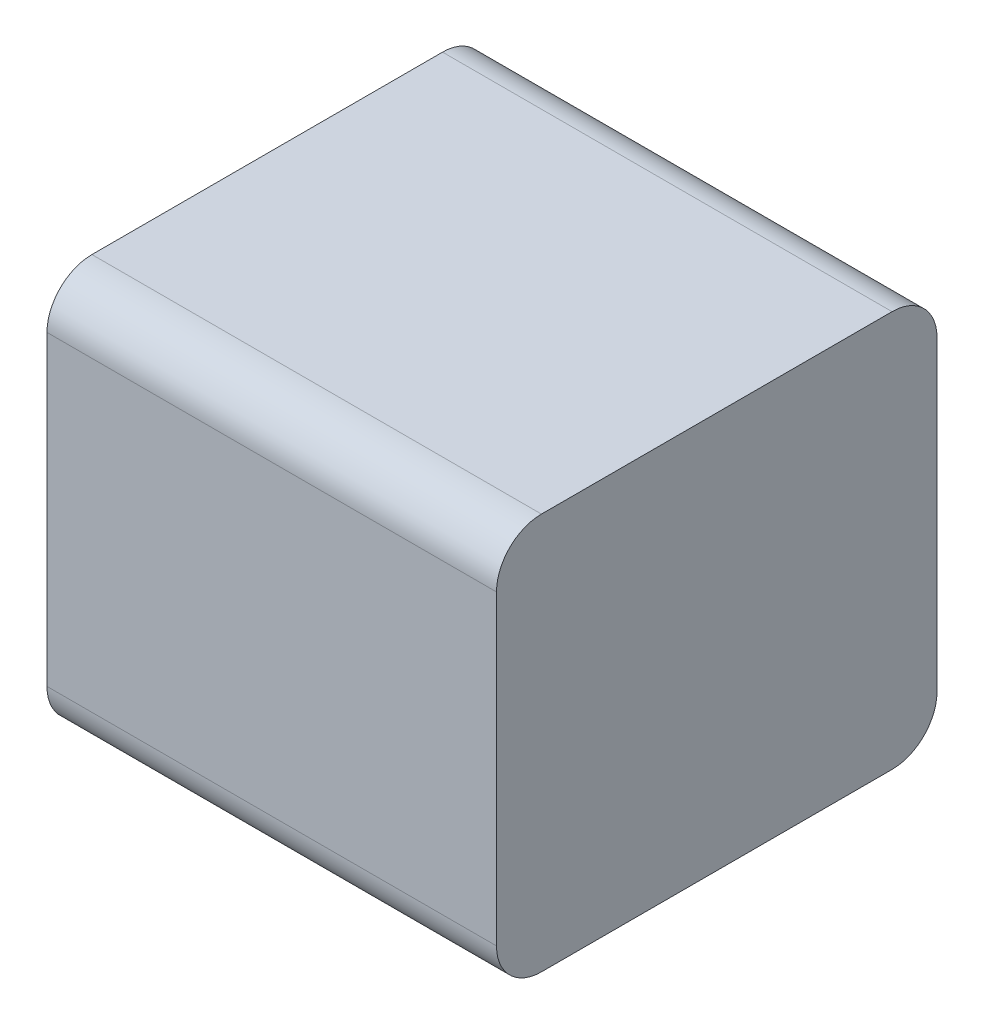
ISO-10303-21;
HEADER;
FILE_DESCRIPTION(('STEP AP214'),'2;1');
FILE_NAME('part.step','',(''),(''),'','','');
FILE_SCHEMA(('AUTOMOTIVE_DESIGN { 1 0 10303 214 1 1 1 1 }'));
ENDSEC;
DATA;
#1=APPLICATION_CONTEXT('core data for automotive mechanical design processes');
#2=APPLICATION_PROTOCOL_DEFINITION('international standard','automotive_design',2000,#1);
#3=PRODUCT_CONTEXT('',#1,'mechanical');
#4=PRODUCT('Part','Part','',(#3));
#5=PRODUCT_RELATED_PRODUCT_CATEGORY('part','',(#4));
#6=PRODUCT_DEFINITION_FORMATION('','',#4);
#7=PRODUCT_DEFINITION_CONTEXT('part definition',#1,'design');
#8=PRODUCT_DEFINITION('design','',#6,#7);
#9=PRODUCT_DEFINITION_SHAPE('','',#8);
#10=(LENGTH_UNIT() NAMED_UNIT(*) SI_UNIT(.MILLI.,.METRE.));
#11=(NAMED_UNIT(*) PLANE_ANGLE_UNIT() SI_UNIT($,.RADIAN.));
#12=(NAMED_UNIT(*) SI_UNIT($,.STERADIAN.) SOLID_ANGLE_UNIT());
#13=UNCERTAINTY_MEASURE_WITH_UNIT(LENGTH_MEASURE(1.E-05),#10,'distance_accuracy_value','');
#14=(GEOMETRIC_REPRESENTATION_CONTEXT(3) GLOBAL_UNCERTAINTY_ASSIGNED_CONTEXT((#13)) GLOBAL_UNIT_ASSIGNED_CONTEXT((#10,
#11,#12)) REPRESENTATION_CONTEXT('',''));
#15=CARTESIAN_POINT('',(0.,0.,0.));
#16=DIRECTION('',(0.,0.,1.));
#17=DIRECTION('',(1.,0.,0.));
#18=AXIS2_PLACEMENT_3D('',#15,#16,#17);
#19=CARTESIAN_POINT('',(-0.45,-0.3969,0.009));
#20=DIRECTION('',(1.,0.,0.));
#21=DIRECTION('',(0.,0.,1.));
#22=AXIS2_PLACEMENT_3D('',#19,#20,#21);
#23=PLANE('',#22);
#24=CARTESIAN_POINT('',(-0.45,-0.3069,0.801));
#25=DIRECTION('',(-1.,0.,0.));
#26=DIRECTION('',(0.,0.,1.));
#27=AXIS2_PLACEMENT_3D('',#24,#25,#26);
#28=CIRCLE('',#27,0.09);
#29=CARTESIAN_POINT('',(-0.45,-0.3969,0.801));
#30=VERTEX_POINT('',#29);
#31=CARTESIAN_POINT('',(-0.45,-0.3069,0.891));
#32=VERTEX_POINT('',#31);
#33=EDGE_CURVE('E11',#30,#32,#28,.T.);
#34=ORIENTED_EDGE('',*,*,#33,.T.);
#35=DIRECTION('',(0.,1.,0.));
#36=VECTOR('',#35,1.);
#37=CARTESIAN_POINT('',(-0.45,-0.3969,0.891));
#38=LINE('',#37,#36);
#39=CARTESIAN_POINT('',(-0.45,0.3069,0.891));
#40=VERTEX_POINT('',#39);
#41=EDGE_CURVE('E24',#32,#40,#38,.T.);
#42=ORIENTED_EDGE('',*,*,#41,.T.);
#43=CARTESIAN_POINT('',(-0.45,0.3069,0.801));
#44=DIRECTION('',(1.,0.,0.));
#45=DIRECTION('',(0.,0.,1.));
#46=AXIS2_PLACEMENT_3D('',#43,#44,#45);
#47=CIRCLE('',#46,0.09);
#48=CARTESIAN_POINT('',(-0.45,0.3969,0.801));
#49=VERTEX_POINT('',#48);
#50=EDGE_CURVE('E143',#49,#40,#47,.T.);
#51=ORIENTED_EDGE('',*,*,#50,.F.);
#52=DIRECTION('',(0.,0.,1.));
#53=VECTOR('',#52,1.);
#54=CARTESIAN_POINT('',(-0.45,0.3969,0.009));
#55=LINE('',#54,#53);
#56=CARTESIAN_POINT('',(-0.45,0.3969,0.099));
#57=VERTEX_POINT('',#56);
#58=EDGE_CURVE('E98',#57,#49,#55,.T.);
#59=ORIENTED_EDGE('',*,*,#58,.F.);
#60=CARTESIAN_POINT('',(-0.45,0.3069,0.099));
#61=DIRECTION('',(-1.,0.,0.));
#62=DIRECTION('',(0.,0.,1.));
#63=AXIS2_PLACEMENT_3D('',#60,#61,#62);
#64=CIRCLE('',#63,0.09);
#65=CARTESIAN_POINT('',(-0.45,0.3069,0.009));
#66=VERTEX_POINT('',#65);
#67=EDGE_CURVE('E139',#57,#66,#64,.T.);
#68=ORIENTED_EDGE('',*,*,#67,.T.);
#69=DIRECTION('',(0.,1.,0.));
#70=VECTOR('',#69,1.);
#71=CARTESIAN_POINT('',(-0.45,-0.3969,0.009));
#72=LINE('',#71,#70);
#73=CARTESIAN_POINT('',(-0.45,-0.3069,0.009));
#74=VERTEX_POINT('',#73);
#75=EDGE_CURVE('E137',#74,#66,#72,.T.);
#76=ORIENTED_EDGE('',*,*,#75,.F.);
#77=CARTESIAN_POINT('',(-0.45,-0.3069,0.099));
#78=DIRECTION('',(1.,0.,0.));
#79=DIRECTION('',(0.,0.,1.));
#80=AXIS2_PLACEMENT_3D('',#77,#78,#79);
#81=CIRCLE('',#80,0.09);
#82=CARTESIAN_POINT('',(-0.45,-0.3969,0.099));
#83=VERTEX_POINT('',#82);
#84=EDGE_CURVE('E135',#83,#74,#81,.T.);
#85=ORIENTED_EDGE('',*,*,#84,.F.);
#86=DIRECTION('',(0.,0.,1.));
#87=VECTOR('',#86,1.);
#88=CARTESIAN_POINT('',(-0.45,-0.3969,0.009));
#89=LINE('',#88,#87);
#90=EDGE_CURVE('E36',#83,#30,#89,.T.);
#91=ORIENTED_EDGE('',*,*,#90,.T.);
#92=EDGE_LOOP('',(#34,#42,#51,#59,#68,#76,#85,#91));
#93=FACE_BOUND('',#92,.T.);
#94=ADVANCED_FACE('F17',(#93),#23,.F.);
#95=CARTESIAN_POINT('',(-0.45,-0.3969,0.009));
#96=DIRECTION('',(0.,1.,0.));
#97=DIRECTION('',(0.,0.,1.));
#98=AXIS2_PLACEMENT_3D('',#95,#96,#97);
#99=PLANE('',#98);
#100=DIRECTION('',(1.,0.,0.));
#101=VECTOR('',#100,1.);
#102=CARTESIAN_POINT('',(-0.45,-0.3969,0.801));
#103=LINE('',#102,#101);
#104=CARTESIAN_POINT('',(0.45,-0.3969,0.801));
#105=VERTEX_POINT('',#104);
#106=EDGE_CURVE('E131',#30,#105,#103,.T.);
#107=ORIENTED_EDGE('',*,*,#106,.F.);
#108=ORIENTED_EDGE('',*,*,#90,.F.);
#109=DIRECTION('',(1.,0.,0.));
#110=VECTOR('',#109,1.);
#111=CARTESIAN_POINT('',(-0.45,-0.3969,0.099));
#112=LINE('',#111,#110);
#113=CARTESIAN_POINT('',(0.45,-0.3969,0.099));
#114=VERTEX_POINT('',#113);
#115=EDGE_CURVE('E128',#83,#114,#112,.T.);
#116=ORIENTED_EDGE('',*,*,#115,.T.);
#117=DIRECTION('',(0.,0.,1.));
#118=VECTOR('',#117,1.);
#119=CARTESIAN_POINT('',(0.45,-0.3969,0.009));
#120=LINE('',#119,#118);
#121=EDGE_CURVE('E126',#114,#105,#120,.T.);
#122=ORIENTED_EDGE('',*,*,#121,.T.);
#123=EDGE_LOOP('',(#107,#108,#116,#122));
#124=FACE_BOUND('',#123,.T.);
#125=ADVANCED_FACE('F151',(#124),#99,.F.);
#126=CARTESIAN_POINT('',(-0.45,-0.3069,0.099));
#127=DIRECTION('',(1.,0.,0.));
#128=DIRECTION('',(0.,-1.,0.));
#129=AXIS2_PLACEMENT_3D('',#126,#127,#128);
#130=CYLINDRICAL_SURFACE('',#129,0.09);
#131=ORIENTED_EDGE('',*,*,#84,.T.);
#132=DIRECTION('',(1.,0.,0.));
#133=VECTOR('',#132,1.);
#134=CARTESIAN_POINT('',(-0.45,-0.3069,0.009));
#135=LINE('',#134,#133);
#136=CARTESIAN_POINT('',(0.45,-0.3069,0.009));
#137=VERTEX_POINT('',#136);
#138=EDGE_CURVE('E124',#74,#137,#135,.T.);
#139=ORIENTED_EDGE('',*,*,#138,.T.);
#140=CARTESIAN_POINT('',(0.45,-0.3069,0.099));
#141=DIRECTION('',(1.,0.,0.));
#142=DIRECTION('',(0.,0.,1.));
#143=AXIS2_PLACEMENT_3D('',#140,#141,#142);
#144=CIRCLE('',#143,0.09);
#145=EDGE_CURVE('E121',#114,#137,#144,.T.);
#146=ORIENTED_EDGE('',*,*,#145,.F.);
#147=ORIENTED_EDGE('',*,*,#115,.F.);
#148=EDGE_LOOP('',(#131,#139,#146,#147));
#149=FACE_BOUND('',#148,.T.);
#150=ADVANCED_FACE('F155',(#149),#130,.T.);
#151=CARTESIAN_POINT('',(-0.45,-0.3069,0.801));
#152=DIRECTION('',(1.,0.,0.));
#153=DIRECTION('',(0.,-1.,0.));
#154=AXIS2_PLACEMENT_3D('',#151,#152,#153);
#155=CYLINDRICAL_SURFACE('',#154,0.09);
#156=ORIENTED_EDGE('',*,*,#106,.T.);
#157=CARTESIAN_POINT('',(0.45,-0.3069,0.801));
#158=DIRECTION('',(-1.,0.,0.));
#159=DIRECTION('',(0.,0.,1.));
#160=AXIS2_PLACEMENT_3D('',#157,#158,#159);
#161=CIRCLE('',#160,0.09);
#162=CARTESIAN_POINT('',(0.45,-0.3069,0.891));
#163=VERTEX_POINT('',#162);
#164=EDGE_CURVE('E119',#105,#163,#161,.T.);
#165=ORIENTED_EDGE('',*,*,#164,.T.);
#166=DIRECTION('',(1.,0.,0.));
#167=VECTOR('',#166,1.);
#168=CARTESIAN_POINT('',(-0.45,-0.3069,0.891));
#169=LINE('',#168,#167);
#170=EDGE_CURVE('E117',#32,#163,#169,.T.);
#171=ORIENTED_EDGE('',*,*,#170,.F.);
#172=ORIENTED_EDGE('',*,*,#33,.F.);
#173=EDGE_LOOP('',(#156,#165,#171,#172));
#174=FACE_BOUND('',#173,.T.);
#175=ADVANCED_FACE('F148',(#174),#155,.T.);
#176=CARTESIAN_POINT('',(-0.45,-0.3969,0.009));
#177=DIRECTION('',(0.,0.,1.));
#178=DIRECTION('',(1.,0.,0.));
#179=AXIS2_PLACEMENT_3D('',#176,#177,#178);
#180=PLANE('',#179);
#181=DIRECTION('',(1.,0.,0.));
#182=VECTOR('',#181,1.);
#183=CARTESIAN_POINT('',(-0.45,0.3069,0.009));
#184=LINE('',#183,#182);
#185=CARTESIAN_POINT('',(0.45,0.3069,0.009));
#186=VERTEX_POINT('',#185);
#187=EDGE_CURVE('E114',#66,#186,#184,.T.);
#188=ORIENTED_EDGE('',*,*,#187,.T.);
#189=DIRECTION('',(0.,1.,0.));
#190=VECTOR('',#189,1.);
#191=CARTESIAN_POINT('',(0.45,-0.3969,0.009));
#192=LINE('',#191,#190);
#193=EDGE_CURVE('E112',#137,#186,#192,.T.);
#194=ORIENTED_EDGE('',*,*,#193,.F.);
#195=ORIENTED_EDGE('',*,*,#138,.F.);
#196=ORIENTED_EDGE('',*,*,#75,.T.);
#197=EDGE_LOOP('',(#188,#194,#195,#196));
#198=FACE_BOUND('',#197,.T.);
#199=ADVANCED_FACE('F159',(#198),#180,.F.);
#200=CARTESIAN_POINT('',(-0.45,-0.3969,0.891));
#201=DIRECTION('',(0.,0.,1.));
#202=DIRECTION('',(1.,0.,0.));
#203=AXIS2_PLACEMENT_3D('',#200,#201,#202);
#204=PLANE('',#203);
#205=ORIENTED_EDGE('',*,*,#41,.F.);
#206=ORIENTED_EDGE('',*,*,#170,.T.);
#207=DIRECTION('',(0.,1.,0.));
#208=VECTOR('',#207,1.);
#209=CARTESIAN_POINT('',(0.45,-0.3969,0.891));
#210=LINE('',#209,#208);
#211=CARTESIAN_POINT('',(0.45,0.3069,0.891));
#212=VERTEX_POINT('',#211);
#213=EDGE_CURVE('E110',#163,#212,#210,.T.);
#214=ORIENTED_EDGE('',*,*,#213,.T.);
#215=DIRECTION('',(1.,0.,0.));
#216=VECTOR('',#215,1.);
#217=CARTESIAN_POINT('',(-0.45,0.3069,0.891));
#218=LINE('',#217,#216);
#219=EDGE_CURVE('E86',#40,#212,#218,.T.);
#220=ORIENTED_EDGE('',*,*,#219,.F.);
#221=EDGE_LOOP('',(#205,#206,#214,#220));
#222=FACE_BOUND('',#221,.T.);
#223=ADVANCED_FACE('F145',(#222),#204,.T.);
#224=CARTESIAN_POINT('',(-0.45,0.3069,0.099));
#225=DIRECTION('',(1.,0.,0.));
#226=DIRECTION('',(0.,1.,0.));
#227=AXIS2_PLACEMENT_3D('',#224,#225,#226);
#228=CYLINDRICAL_SURFACE('',#227,0.09);
#229=DIRECTION('',(1.,0.,0.));
#230=VECTOR('',#229,1.);
#231=CARTESIAN_POINT('',(-0.45,0.3969,0.099));
#232=LINE('',#231,#230);
#233=CARTESIAN_POINT('',(0.45,0.3969,0.099));
#234=VERTEX_POINT('',#233);
#235=EDGE_CURVE('E107',#57,#234,#232,.T.);
#236=ORIENTED_EDGE('',*,*,#235,.T.);
#237=CARTESIAN_POINT('',(0.45,0.3069,0.099));
#238=DIRECTION('',(-1.,0.,0.));
#239=DIRECTION('',(0.,0.,1.));
#240=AXIS2_PLACEMENT_3D('',#237,#238,#239);
#241=CIRCLE('',#240,0.09);
#242=EDGE_CURVE('E90',#234,#186,#241,.T.);
#243=ORIENTED_EDGE('',*,*,#242,.T.);
#244=ORIENTED_EDGE('',*,*,#187,.F.);
#245=ORIENTED_EDGE('',*,*,#67,.F.);
#246=EDGE_LOOP('',(#236,#243,#244,#245));
#247=FACE_BOUND('',#246,.T.);
#248=ADVANCED_FACE('F163',(#247),#228,.T.);
#249=CARTESIAN_POINT('',(-0.45,0.3069,0.801));
#250=DIRECTION('',(1.,0.,0.));
#251=DIRECTION('',(0.,1.,0.));
#252=AXIS2_PLACEMENT_3D('',#249,#250,#251);
#253=CYLINDRICAL_SURFACE('',#252,0.09);
#254=ORIENTED_EDGE('',*,*,#50,.T.);
#255=ORIENTED_EDGE('',*,*,#219,.T.);
#256=CARTESIAN_POINT('',(0.45,0.3069,0.801));
#257=DIRECTION('',(1.,0.,0.));
#258=DIRECTION('',(0.,0.,1.));
#259=AXIS2_PLACEMENT_3D('',#256,#257,#258);
#260=CIRCLE('',#259,0.09);
#261=CARTESIAN_POINT('',(0.45,0.3969,0.801));
#262=VERTEX_POINT('',#261);
#263=EDGE_CURVE('E82',#262,#212,#260,.T.);
#264=ORIENTED_EDGE('',*,*,#263,.F.);
#265=DIRECTION('',(1.,0.,0.));
#266=VECTOR('',#265,1.);
#267=CARTESIAN_POINT('',(-0.45,0.3969,0.801));
#268=LINE('',#267,#266);
#269=EDGE_CURVE('E85',#49,#262,#268,.T.);
#270=ORIENTED_EDGE('',*,*,#269,.F.);
#271=EDGE_LOOP('',(#254,#255,#264,#270));
#272=FACE_BOUND('',#271,.T.);
#273=ADVANCED_FACE('F84',(#272),#253,.T.);
#274=CARTESIAN_POINT('',(-0.45,0.3969,0.009));
#275=DIRECTION('',(0.,1.,0.));
#276=DIRECTION('',(0.,0.,1.));
#277=AXIS2_PLACEMENT_3D('',#274,#275,#276);
#278=PLANE('',#277);
#279=DIRECTION('',(0.,0.,1.));
#280=VECTOR('',#279,1.);
#281=CARTESIAN_POINT('',(0.45,0.3969,0.009));
#282=LINE('',#281,#280);
#283=EDGE_CURVE('E96',#234,#262,#282,.T.);
#284=ORIENTED_EDGE('',*,*,#283,.F.);
#285=ORIENTED_EDGE('',*,*,#235,.F.);
#286=ORIENTED_EDGE('',*,*,#58,.T.);
#287=ORIENTED_EDGE('',*,*,#269,.T.);
#288=EDGE_LOOP('',(#284,#285,#286,#287));
#289=FACE_BOUND('',#288,.T.);
#290=ADVANCED_FACE('F94',(#289),#278,.T.);
#291=CARTESIAN_POINT('',(0.45,-0.3969,0.009));
#292=DIRECTION('',(1.,0.,0.));
#293=DIRECTION('',(0.,0.,1.));
#294=AXIS2_PLACEMENT_3D('',#291,#292,#293);
#295=PLANE('',#294);
#296=ORIENTED_EDGE('',*,*,#121,.F.);
#297=ORIENTED_EDGE('',*,*,#145,.T.);
#298=ORIENTED_EDGE('',*,*,#193,.T.);
#299=ORIENTED_EDGE('',*,*,#242,.F.);
#300=ORIENTED_EDGE('',*,*,#283,.T.);
#301=ORIENTED_EDGE('',*,*,#263,.T.);
#302=ORIENTED_EDGE('',*,*,#213,.F.);
#303=ORIENTED_EDGE('',*,*,#164,.F.);
#304=EDGE_LOOP('',(#296,#297,#298,#299,#300,#301,#302,#303));
#305=FACE_BOUND('',#304,.T.);
#306=ADVANCED_FACE('F102',(#305),#295,.T.);
#307=CLOSED_SHELL('',(#94,#125,#150,#175,#199,#223,#248,#273,#290,#306));
#308=MANIFOLD_SOLID_BREP('B1',#307);
#309=ADVANCED_BREP_SHAPE_REPRESENTATION('',(#18,#308),#14);
#310=SHAPE_DEFINITION_REPRESENTATION(#9,#309);
ENDSEC;
END-ISO-10303-21;
